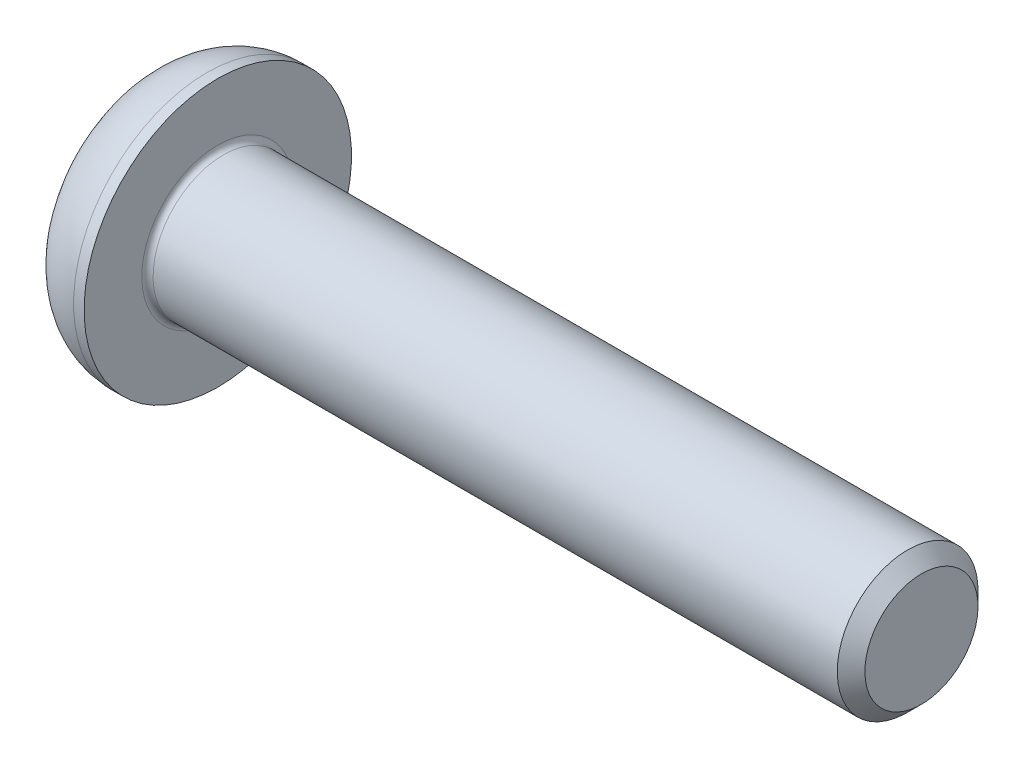
ISO-10303-21;
HEADER;
FILE_DESCRIPTION(('STEP AP214'),'2;1');
FILE_NAME('part.step','',(''),(''),'','','');
FILE_SCHEMA(('AUTOMOTIVE_DESIGN { 1 0 10303 214 1 1 1 1 }'));
ENDSEC;
DATA;
#1=APPLICATION_CONTEXT('core data for automotive mechanical design processes');
#2=APPLICATION_PROTOCOL_DEFINITION('international standard','automotive_design',2000,#1);
#3=PRODUCT_CONTEXT('',#1,'mechanical');
#4=PRODUCT('Part','Part','',(#3));
#5=PRODUCT_RELATED_PRODUCT_CATEGORY('part','',(#4));
#6=PRODUCT_DEFINITION_FORMATION('','',#4);
#7=PRODUCT_DEFINITION_CONTEXT('part definition',#1,'design');
#8=PRODUCT_DEFINITION('design','',#6,#7);
#9=PRODUCT_DEFINITION_SHAPE('','',#8);
#10=(LENGTH_UNIT() NAMED_UNIT(*) SI_UNIT(.MILLI.,.METRE.));
#11=(NAMED_UNIT(*) PLANE_ANGLE_UNIT() SI_UNIT($,.RADIAN.));
#12=(NAMED_UNIT(*) SI_UNIT($,.STERADIAN.) SOLID_ANGLE_UNIT());
#13=UNCERTAINTY_MEASURE_WITH_UNIT(LENGTH_MEASURE(1.E-05),#10,'distance_accuracy_value','');
#14=(GEOMETRIC_REPRESENTATION_CONTEXT(3) GLOBAL_UNCERTAINTY_ASSIGNED_CONTEXT((#13)) GLOBAL_UNIT_ASSIGNED_CONTEXT((#10,
#11,#12)) REPRESENTATION_CONTEXT('',''));
#15=CARTESIAN_POINT('',(0.,0.,0.));
#16=DIRECTION('',(0.,0.,1.));
#17=DIRECTION('',(1.,0.,0.));
#18=AXIS2_PLACEMENT_3D('',#15,#16,#17);
#19=CARTESIAN_POINT('',(0.200000000000002,0.,0.));
#20=DIRECTION('',(1.,0.,0.));
#21=DIRECTION('',(0.,1.,0.));
#22=AXIS2_PLACEMENT_3D('',#19,#20,#21);
#23=TOROIDAL_SURFACE('',#22,2.7,0.2);
#24=CARTESIAN_POINT('',(0.,0.,0.));
#25=DIRECTION('',(1.,0.,0.));
#26=DIRECTION('',(0.,1.,0.));
#27=AXIS2_PLACEMENT_3D('',#24,#25,#26);
#28=CIRCLE('',#27,2.7);
#29=CARTESIAN_POINT('',(0.,2.7,0.));
#30=VERTEX_POINT('',#29);
#31=EDGE_CURVE('E9',#30,#30,#28,.T.);
#32=ORIENTED_EDGE('',*,*,#31,.T.);
#33=EDGE_LOOP('',(#32));
#34=FACE_BOUND('',#33,.T.);
#35=CARTESIAN_POINT('',(0.200000000000002,0.,0.));
#36=DIRECTION('',(-1.,0.,0.));
#37=DIRECTION('',(0.,1.,0.));
#38=AXIS2_PLACEMENT_3D('',#35,#36,#37);
#39=CIRCLE('',#38,2.5);
#40=CARTESIAN_POINT('',(0.200000000000002,2.5,0.));
#41=VERTEX_POINT('',#40);
#42=EDGE_CURVE('E26',#41,#41,#39,.T.);
#43=ORIENTED_EDGE('',*,*,#42,.T.);
#44=EDGE_LOOP('',(#43));
#45=FACE_BOUND('',#44,.T.);
#46=ADVANCED_FACE('F15',(#34,#45),#23,.F.);
#47=CARTESIAN_POINT('',(13.3,0.,0.));
#48=DIRECTION('',(1.,0.,0.));
#49=DIRECTION('',(0.,1.,0.));
#50=AXIS2_PLACEMENT_3D('',#47,#48,#49);
#51=CYLINDRICAL_SURFACE('',#50,2.5);
#52=CARTESIAN_POINT('',(24.50924,0.,0.));
#53=DIRECTION('',(1.,0.,0.));
#54=DIRECTION('',(0.,1.,0.));
#55=AXIS2_PLACEMENT_3D('',#52,#53,#54);
#56=CIRCLE('',#55,2.5);
#57=CARTESIAN_POINT('',(24.50924,2.5,0.));
#58=VERTEX_POINT('',#57);
#59=EDGE_CURVE('E160',#58,#58,#56,.T.);
#60=ORIENTED_EDGE('',*,*,#59,.F.);
#61=EDGE_LOOP('',(#60));
#62=FACE_BOUND('',#61,.T.);
#63=ORIENTED_EDGE('',*,*,#42,.F.);
#64=EDGE_LOOP('',(#63));
#65=FACE_BOUND('',#64,.T.);
#66=ADVANCED_FACE('F170',(#62,#65),#51,.T.);
#67=CARTESIAN_POINT('',(0.,3.625,0.));
#68=DIRECTION('',(1.,0.,0.));
#69=DIRECTION('',(0.,1.,0.));
#70=AXIS2_PLACEMENT_3D('',#67,#68,#69);
#71=PLANE('',#70);
#72=CARTESIAN_POINT('',(0.,0.,0.));
#73=DIRECTION('',(1.,0.,0.));
#74=DIRECTION('',(0.,1.,0.));
#75=AXIS2_PLACEMENT_3D('',#72,#73,#74);
#76=CIRCLE('',#75,4.75);
#77=CARTESIAN_POINT('',(0.,4.75,0.));
#78=VERTEX_POINT('',#77);
#79=EDGE_CURVE('E161',#78,#78,#76,.T.);
#80=ORIENTED_EDGE('',*,*,#79,.T.);
#81=EDGE_LOOP('',(#80));
#82=FACE_BOUND('',#81,.T.);
#83=ORIENTED_EDGE('',*,*,#31,.F.);
#84=EDGE_LOOP('',(#83));
#85=FACE_BOUND('',#84,.T.);
#86=ADVANCED_FACE('F172',(#82,#85),#71,.T.);
#87=CARTESIAN_POINT('',(24.75462,0.,0.));
#88=DIRECTION('',(-1.,0.,0.));
#89=DIRECTION('',(0.,1.,0.));
#90=AXIS2_PLACEMENT_3D('',#87,#88,#89);
#91=CONICAL_SURFACE('',#90,2.25462,0.785398163397447);
#92=ORIENTED_EDGE('',*,*,#59,.T.);
#93=EDGE_LOOP('',(#92));
#94=FACE_BOUND('',#93,.T.);
#95=CARTESIAN_POINT('',(25.,0.,0.));
#96=DIRECTION('',(-1.,0.,0.));
#97=DIRECTION('',(0.,1.,0.));
#98=AXIS2_PLACEMENT_3D('',#95,#96,#97);
#99=CIRCLE('',#98,2.00924);
#100=CARTESIAN_POINT('',(25.,2.00924,0.));
#101=VERTEX_POINT('',#100);
#102=EDGE_CURVE('E157',#101,#101,#99,.T.);
#103=ORIENTED_EDGE('',*,*,#102,.T.);
#104=EDGE_LOOP('',(#103));
#105=FACE_BOUND('',#104,.T.);
#106=ADVANCED_FACE('F180',(#94,#105),#91,.T.);
#107=CARTESIAN_POINT('',(25.,1.25,0.));
#108=DIRECTION('',(1.,0.,0.));
#109=DIRECTION('',(0.,1.,0.));
#110=AXIS2_PLACEMENT_3D('',#107,#108,#109);
#111=PLANE('',#110);
#112=ORIENTED_EDGE('',*,*,#102,.F.);
#113=EDGE_LOOP('',(#112));
#114=FACE_BOUND('',#113,.T.);
#115=ADVANCED_FACE('F190',(#114),#111,.T.);
#116=CARTESIAN_POINT('',(-0.374999999999994,0.,0.));
#117=DIRECTION('',(1.,0.,0.));
#118=DIRECTION('',(0.,1.,0.));
#119=AXIS2_PLACEMENT_3D('',#116,#117,#118);
#120=TOROIDAL_SURFACE('',#119,2.375,2.375);
#121=CARTESIAN_POINT('',(-2.74999999999999,0.,0.));
#122=DIRECTION('',(1.,0.,0.));
#123=DIRECTION('',(0.,1.,0.));
#124=AXIS2_PLACEMENT_3D('',#121,#122,#123);
#125=CIRCLE('',#124,2.375);
#126=CARTESIAN_POINT('',(-2.74999999999999,2.375,0.));
#127=VERTEX_POINT('',#126);
#128=EDGE_CURVE('E154',#127,#127,#125,.T.);
#129=ORIENTED_EDGE('',*,*,#128,.T.);
#130=EDGE_LOOP('',(#129));
#131=FACE_BOUND('',#130,.T.);
#132=CARTESIAN_POINT('',(-0.374999999999994,0.,0.));
#133=DIRECTION('',(-1.,0.,0.));
#134=DIRECTION('',(0.,1.,0.));
#135=AXIS2_PLACEMENT_3D('',#132,#133,#134);
#136=CIRCLE('',#135,4.75);
#137=CARTESIAN_POINT('',(-0.374999999999994,4.75,0.));
#138=VERTEX_POINT('',#137);
#139=EDGE_CURVE('E151',#138,#138,#136,.T.);
#140=ORIENTED_EDGE('',*,*,#139,.T.);
#141=EDGE_LOOP('',(#140));
#142=FACE_BOUND('',#141,.T.);
#143=ADVANCED_FACE('F204',(#131,#142),#120,.T.);
#144=CARTESIAN_POINT('',(-2.74999999999999,3.24102540378444,0.));
#145=DIRECTION('',(-1.,0.,0.));
#146=DIRECTION('',(0.,-1.,0.));
#147=AXIS2_PLACEMENT_3D('',#144,#145,#146);
#148=PLANE('',#147);
#149=DIRECTION('',(0.,0.,1.));
#150=VECTOR('',#149,1.);
#151=CARTESIAN_POINT('',(-2.74999999999999,1.5,0.433012701892218));
#152=LINE('',#151,#150);
#153=CARTESIAN_POINT('',(-2.74999999999999,1.5,-0.866025403784439));
#154=VERTEX_POINT('',#153);
#155=CARTESIAN_POINT('',(-2.74999999999999,1.5,0.866025403784437));
#156=VERTEX_POINT('',#155);
#157=EDGE_CURVE('E149',#154,#156,#152,.T.);
#158=ORIENTED_EDGE('',*,*,#157,.T.);
#159=DIRECTION('',(0.,-0.866025403784438,0.500000000000001));
#160=VECTOR('',#159,1.);
#161=CARTESIAN_POINT('',(-2.74999999999999,0.375,1.51554445662277));
#162=LINE('',#161,#160);
#163=CARTESIAN_POINT('',(-2.74999999999999,0.,1.73205080756888));
#164=VERTEX_POINT('',#163);
#165=EDGE_CURVE('E38',#156,#164,#162,.T.);
#166=ORIENTED_EDGE('',*,*,#165,.T.);
#167=DIRECTION('',(0.,-0.866025403784439,-0.5));
#168=VECTOR('',#167,1.);
#169=CARTESIAN_POINT('',(-2.74999999999999,-1.125,1.08253175473055));
#170=LINE('',#169,#168);
#171=CARTESIAN_POINT('',(-2.74999999999999,-1.5,0.866025403784439));
#172=VERTEX_POINT('',#171);
#173=EDGE_CURVE('E94',#164,#172,#170,.T.);
#174=ORIENTED_EDGE('',*,*,#173,.T.);
#175=DIRECTION('',(0.,0.,-1.));
#176=VECTOR('',#175,1.);
#177=CARTESIAN_POINT('',(-2.74999999999999,-1.5,-0.433012701892219));
#178=LINE('',#177,#176);
#179=CARTESIAN_POINT('',(-2.74999999999999,-1.5,-0.866025403784438));
#180=VERTEX_POINT('',#179);
#181=EDGE_CURVE('E87',#172,#180,#178,.T.);
#182=ORIENTED_EDGE('',*,*,#181,.T.);
#183=DIRECTION('',(0.,0.866025403784439,-0.5));
#184=VECTOR('',#183,1.);
#185=CARTESIAN_POINT('',(-2.74999999999999,-0.375,-1.51554445662277));
#186=LINE('',#185,#184);
#187=CARTESIAN_POINT('',(-2.74999999999999,0.,-1.73205080756888));
#188=VERTEX_POINT('',#187);
#189=EDGE_CURVE('E143',#180,#188,#186,.T.);
#190=ORIENTED_EDGE('',*,*,#189,.T.);
#191=DIRECTION('',(0.,0.866025403784439,0.5));
#192=VECTOR('',#191,1.);
#193=CARTESIAN_POINT('',(-2.74999999999999,1.125,-1.08253175473055));
#194=LINE('',#193,#192);
#195=EDGE_CURVE('E134',#188,#154,#194,.T.);
#196=ORIENTED_EDGE('',*,*,#195,.T.);
#197=EDGE_LOOP('',(#158,#166,#174,#182,#190,#196));
#198=FACE_BOUND('',#197,.T.);
#199=ORIENTED_EDGE('',*,*,#128,.F.);
#200=EDGE_LOOP('',(#199));
#201=FACE_BOUND('',#200,.T.);
#202=ADVANCED_FACE('F195',(#198,#201),#148,.T.);
#203=CARTESIAN_POINT('',(-1.375,0.,0.));
#204=DIRECTION('',(1.,0.,0.));
#205=DIRECTION('',(0.,1.,0.));
#206=AXIS2_PLACEMENT_3D('',#203,#204,#205);
#207=CYLINDRICAL_SURFACE('',#206,4.75);
#208=ORIENTED_EDGE('',*,*,#79,.F.);
#209=EDGE_LOOP('',(#208));
#210=FACE_BOUND('',#209,.T.);
#211=ORIENTED_EDGE('',*,*,#139,.F.);
#212=EDGE_LOOP('',(#211));
#213=FACE_BOUND('',#212,.T.);
#214=ADVANCED_FACE('F192',(#210,#213),#207,.T.);
#215=CARTESIAN_POINT('',(-2.74999999999999,0.,-1.73205080756888));
#216=DIRECTION('',(0.,-0.5,-0.866025403784439));
#217=DIRECTION('',(0.,0.866025403784439,-0.5));
#218=AXIS2_PLACEMENT_3D('',#215,#216,#217);
#219=PLANE('',#218);
#220=CARTESIAN_POINT('',(-1.18999999999999,0.,-1.73205080756887));
#221=CARTESIAN_POINT('',(-0.939999999999999,-0.750000000000001,-1.29903810567666));
#222=CARTESIAN_POINT('',(-1.18999999999999,-1.49999999999999,-0.866025403784445));
#223=(BOUNDED_CURVE() B_SPLINE_CURVE(2,(#220,#221,#222),.UNSPECIFIED.,.F.,
.F.) B_SPLINE_CURVE_WITH_KNOTS((3,3),(0.,0.175265420711685),
.UNSPECIFIED.) CURVE() GEOMETRIC_REPRESENTATION_ITEM() RATIONAL_B_SPLINE_CURVE((1.,
1.15470053837925,1.)) REPRESENTATION_ITEM(''));
#224=CARTESIAN_POINT('',(-1.19,0.,-1.73205080756888));
#225=VERTEX_POINT('',#224);
#226=CARTESIAN_POINT('',(-1.19,-1.5,-0.866025403784438));
#227=VERTEX_POINT('',#226);
#228=EDGE_CURVE('E78',#225,#227,#223,.T.);
#229=ORIENTED_EDGE('',*,*,#228,.F.);
#230=DIRECTION('',(-1.,0.,0.));
#231=VECTOR('',#230,1.);
#232=CARTESIAN_POINT('',(-1.96999999999999,0.,-1.73205080756888));
#233=LINE('',#232,#231);
#234=EDGE_CURVE('E124',#225,#188,#233,.T.);
#235=ORIENTED_EDGE('',*,*,#234,.T.);
#236=ORIENTED_EDGE('',*,*,#189,.F.);
#237=DIRECTION('',(-1.,0.,0.));
#238=VECTOR('',#237,1.);
#239=CARTESIAN_POINT('',(-1.96999999999999,-1.5,-0.866025403784438));
#240=LINE('',#239,#238);
#241=EDGE_CURVE('E90',#227,#180,#240,.T.);
#242=ORIENTED_EDGE('',*,*,#241,.F.);
#243=EDGE_LOOP('',(#229,#235,#236,#242));
#244=FACE_BOUND('',#243,.T.);
#245=ADVANCED_FACE('F194',(#244),#219,.F.);
#246=CARTESIAN_POINT('',(-2.74999999999999,1.5,-0.866025403784439));
#247=DIRECTION('',(0.,0.5,-0.866025403784439));
#248=DIRECTION('',(0.,0.866025403784439,0.5));
#249=AXIS2_PLACEMENT_3D('',#246,#247,#248);
#250=PLANE('',#249);
#251=CARTESIAN_POINT('',(-1.18999999999999,1.49999999999999,-0.866025403784445));
#252=CARTESIAN_POINT('',(-0.939999999999999,0.75,-1.29903810567666));
#253=CARTESIAN_POINT('',(-1.18999999999999,0.,-1.73205080756887));
#254=(BOUNDED_CURVE() B_SPLINE_CURVE(2,(#251,#252,#253),.UNSPECIFIED.,.F.,
.F.) B_SPLINE_CURVE_WITH_KNOTS((3,3),(0.,0.175265420711685),
.UNSPECIFIED.) CURVE() GEOMETRIC_REPRESENTATION_ITEM() RATIONAL_B_SPLINE_CURVE((1.,
1.15470053837924,1.)) REPRESENTATION_ITEM(''));
#255=CARTESIAN_POINT('',(-1.19,1.5,-0.866025403784441));
#256=VERTEX_POINT('',#255);
#257=EDGE_CURVE('E118',#256,#225,#254,.T.);
#258=ORIENTED_EDGE('',*,*,#257,.F.);
#259=DIRECTION('',(-1.,0.,0.));
#260=VECTOR('',#259,1.);
#261=CARTESIAN_POINT('',(-1.96999999999999,1.5,-0.866025403784441));
#262=LINE('',#261,#260);
#263=EDGE_CURVE('E113',#256,#154,#262,.T.);
#264=ORIENTED_EDGE('',*,*,#263,.T.);
#265=ORIENTED_EDGE('',*,*,#195,.F.);
#266=ORIENTED_EDGE('',*,*,#234,.F.);
#267=EDGE_LOOP('',(#258,#264,#265,#266));
#268=FACE_BOUND('',#267,.T.);
#269=ADVANCED_FACE('F201',(#268),#250,.F.);
#270=CARTESIAN_POINT('',(-2.74999999999999,1.5,0.866025403784437));
#271=DIRECTION('',(0.,1.,0.));
#272=DIRECTION('',(0.,0.,1.));
#273=AXIS2_PLACEMENT_3D('',#270,#271,#272);
#274=PLANE('',#273);
#275=CARTESIAN_POINT('',(-1.18999999999999,1.5,0.866025403784425));
#276=CARTESIAN_POINT('',(-0.939999999999999,1.5,0.));
#277=CARTESIAN_POINT('',(-1.18999999999999,1.5,-0.866025403784428));
#278=(BOUNDED_CURVE() B_SPLINE_CURVE(2,(#275,#276,#277),.UNSPECIFIED.,.F.,
.F.) B_SPLINE_CURVE_WITH_KNOTS((3,3),(0.,0.175265420711685),
.UNSPECIFIED.) CURVE() GEOMETRIC_REPRESENTATION_ITEM() RATIONAL_B_SPLINE_CURVE((1.,
1.15470053837924,1.)) REPRESENTATION_ITEM(''));
#279=CARTESIAN_POINT('',(-1.19,1.5,0.866025403784437));
#280=VERTEX_POINT('',#279);
#281=EDGE_CURVE('E97',#280,#256,#278,.T.);
#282=ORIENTED_EDGE('',*,*,#281,.F.);
#283=DIRECTION('',(-1.,0.,0.));
#284=VECTOR('',#283,1.);
#285=CARTESIAN_POINT('',(-1.96999999999999,1.5,0.866025403784437));
#286=LINE('',#285,#284);
#287=EDGE_CURVE('E107',#280,#156,#286,.T.);
#288=ORIENTED_EDGE('',*,*,#287,.T.);
#289=ORIENTED_EDGE('',*,*,#157,.F.);
#290=ORIENTED_EDGE('',*,*,#263,.F.);
#291=EDGE_LOOP('',(#282,#288,#289,#290));
#292=FACE_BOUND('',#291,.T.);
#293=ADVANCED_FACE('F222',(#292),#274,.F.);
#294=CARTESIAN_POINT('',(-2.74999999999999,0.,1.73205080756888));
#295=DIRECTION('',(0.,0.500000000000001,0.866025403784438));
#296=DIRECTION('',(0.,-0.866025403784438,0.500000000000001));
#297=AXIS2_PLACEMENT_3D('',#294,#295,#296);
#298=PLANE('',#297);
#299=CARTESIAN_POINT('',(-1.18999999999999,0.,1.73205080756887));
#300=CARTESIAN_POINT('',(-0.939999999999998,0.750000000000001,1.29903810567666));
#301=CARTESIAN_POINT('',(-1.18999999999999,1.49999999999999,0.866025403784443));
#302=(BOUNDED_CURVE() B_SPLINE_CURVE(2,(#299,#300,#301),.UNSPECIFIED.,.F.,
.F.) B_SPLINE_CURVE_WITH_KNOTS((3,3),(0.,0.175265420711685),
.UNSPECIFIED.) CURVE() GEOMETRIC_REPRESENTATION_ITEM() RATIONAL_B_SPLINE_CURVE((1.,
1.15470053837924,1.)) REPRESENTATION_ITEM(''));
#303=CARTESIAN_POINT('',(-1.19,0.,1.73205080756888));
#304=VERTEX_POINT('',#303);
#305=EDGE_CURVE('E95',#304,#280,#302,.T.);
#306=ORIENTED_EDGE('',*,*,#305,.F.);
#307=DIRECTION('',(1.,0.,0.));
#308=VECTOR('',#307,1.);
#309=CARTESIAN_POINT('',(-1.96999999999999,0.,1.73205080756888));
#310=LINE('',#309,#308);
#311=EDGE_CURVE('E91',#164,#304,#310,.T.);
#312=ORIENTED_EDGE('',*,*,#311,.F.);
#313=ORIENTED_EDGE('',*,*,#165,.F.);
#314=ORIENTED_EDGE('',*,*,#287,.F.);
#315=EDGE_LOOP('',(#306,#312,#313,#314));
#316=FACE_BOUND('',#315,.T.);
#317=ADVANCED_FACE('F226',(#316),#298,.F.);
#318=CARTESIAN_POINT('',(-2.74999999999999,-1.5,-0.866025403784438));
#319=DIRECTION('',(0.,-1.,0.));
#320=DIRECTION('',(0.,0.,-1.));
#321=AXIS2_PLACEMENT_3D('',#318,#319,#320);
#322=PLANE('',#321);
#323=CARTESIAN_POINT('',(-1.18999999999999,-1.5,-0.866025403784426));
#324=CARTESIAN_POINT('',(-0.939999999999999,-1.5,0.));
#325=CARTESIAN_POINT('',(-1.18999999999999,-1.5,0.866025403784426));
#326=(BOUNDED_CURVE() B_SPLINE_CURVE(2,(#323,#324,#325),.UNSPECIFIED.,.F.,
.F.) B_SPLINE_CURVE_WITH_KNOTS((3,3),(0.,0.175265420711685),
.UNSPECIFIED.) CURVE() GEOMETRIC_REPRESENTATION_ITEM() RATIONAL_B_SPLINE_CURVE((1.,
1.15470053837924,1.)) REPRESENTATION_ITEM(''));
#327=CARTESIAN_POINT('',(-1.19,-1.5,0.866025403784438));
#328=VERTEX_POINT('',#327);
#329=EDGE_CURVE('E73',#227,#328,#326,.T.);
#330=ORIENTED_EDGE('',*,*,#329,.F.);
#331=ORIENTED_EDGE('',*,*,#241,.T.);
#332=ORIENTED_EDGE('',*,*,#181,.F.);
#333=DIRECTION('',(-1.,0.,0.));
#334=VECTOR('',#333,1.);
#335=CARTESIAN_POINT('',(-1.96999999999999,-1.5,0.866025403784438));
#336=LINE('',#335,#334);
#337=EDGE_CURVE('E84',#328,#172,#336,.T.);
#338=ORIENTED_EDGE('',*,*,#337,.F.);
#339=EDGE_LOOP('',(#330,#331,#332,#338));
#340=FACE_BOUND('',#339,.T.);
#341=ADVANCED_FACE('F85',(#340),#322,.F.);
#342=CARTESIAN_POINT('',(-2.74999999999999,-1.5,0.866025403784439));
#343=DIRECTION('',(0.,-0.5,0.866025403784439));
#344=DIRECTION('',(0.,-0.866025403784439,-0.5));
#345=AXIS2_PLACEMENT_3D('',#342,#343,#344);
#346=PLANE('',#345);
#347=CARTESIAN_POINT('',(-1.18999999999999,-1.49999999999999,0.866025403784445));
#348=CARTESIAN_POINT('',(-0.939999999999999,-0.75,1.29903810567666));
#349=CARTESIAN_POINT('',(-1.18999999999999,0.,1.73205080756887));
#350=(BOUNDED_CURVE() B_SPLINE_CURVE(2,(#347,#348,#349),.UNSPECIFIED.,.F.,
.F.) B_SPLINE_CURVE_WITH_KNOTS((3,3),(0.,0.175265420711685),
.UNSPECIFIED.) CURVE() GEOMETRIC_REPRESENTATION_ITEM() RATIONAL_B_SPLINE_CURVE((1.,
1.15470053837925,1.)) REPRESENTATION_ITEM(''));
#351=EDGE_CURVE('E19',#328,#304,#350,.T.);
#352=ORIENTED_EDGE('',*,*,#351,.F.);
#353=ORIENTED_EDGE('',*,*,#337,.T.);
#354=ORIENTED_EDGE('',*,*,#173,.F.);
#355=ORIENTED_EDGE('',*,*,#311,.T.);
#356=EDGE_LOOP('',(#352,#353,#354,#355));
#357=FACE_BOUND('',#356,.T.);
#358=ADVANCED_FACE('F93',(#357),#346,.F.);
#359=CARTESIAN_POINT('',(-0.689999999999995,0.,0.));
#360=DIRECTION('',(-1.,0.,0.));
#361=DIRECTION('',(0.,1.,0.));
#362=AXIS2_PLACEMENT_3D('',#359,#360,#361);
#363=CONICAL_SURFACE('',#362,0.866025403784439,1.0471975511966);
#364=CARTESIAN_POINT('',(-0.189999999999993,0.,0.));
#365=VERTEX_POINT('',#364);
#366=VERTEX_LOOP('',#365);
#367=FACE_BOUND('',#366,.T.);
#368=ORIENTED_EDGE('',*,*,#305,.T.);
#369=ORIENTED_EDGE('',*,*,#281,.T.);
#370=ORIENTED_EDGE('',*,*,#257,.T.);
#371=ORIENTED_EDGE('',*,*,#228,.T.);
#372=ORIENTED_EDGE('',*,*,#329,.T.);
#373=ORIENTED_EDGE('',*,*,#351,.T.);
#374=EDGE_LOOP('',(#368,#369,#370,#371,#372,#373));
#375=FACE_BOUND('',#374,.T.);
#376=ADVANCED_FACE('F17',(#367,#375),#363,.F.);
#377=CLOSED_SHELL('',(#46,#66,#86,#106,#115,#143,#202,#214,#245,#269,#293,#317,#341,#358,#376));
#378=MANIFOLD_SOLID_BREP('B1',#377);
#379=ADVANCED_BREP_SHAPE_REPRESENTATION('',(#18,#378),#14);
#380=SHAPE_DEFINITION_REPRESENTATION(#9,#379);
ENDSEC;
END-ISO-10303-21;
